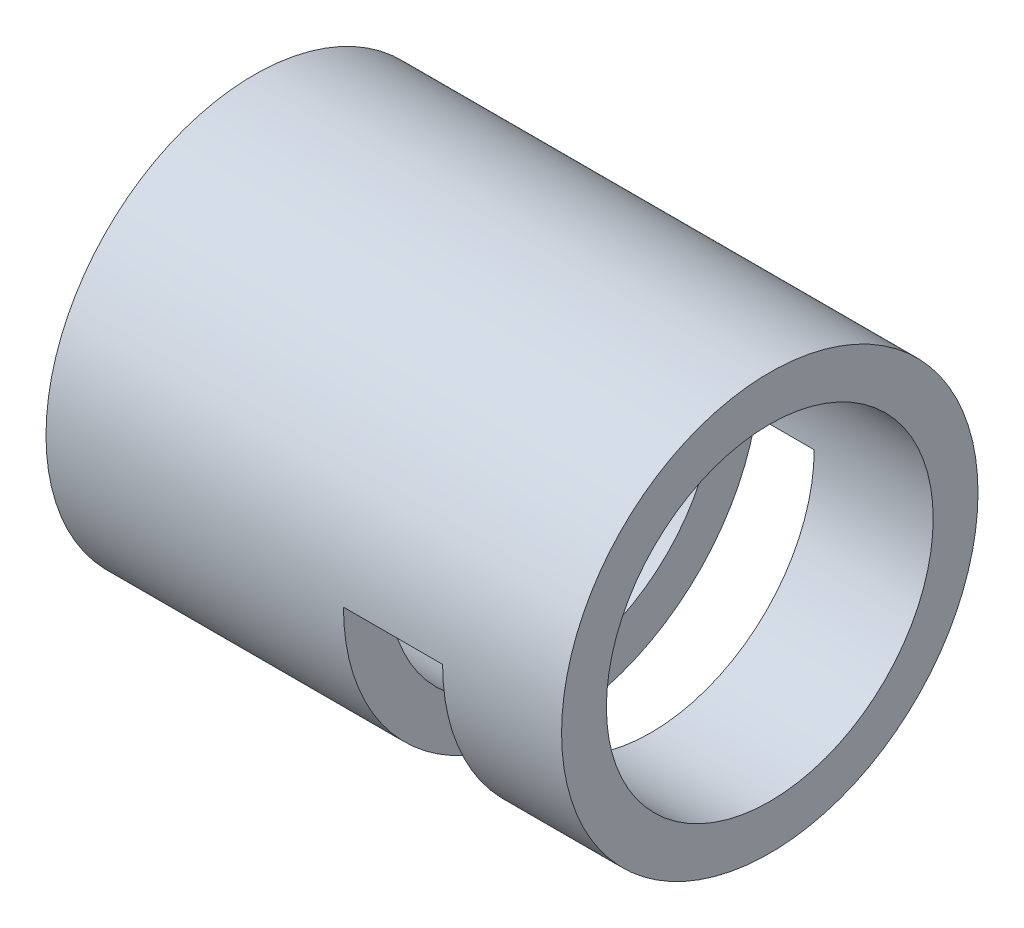
ISO-10303-21;
HEADER;
FILE_DESCRIPTION(('STEP AP214'),'2;1');
FILE_NAME('part.step','',(''),(''),'','','');
FILE_SCHEMA(('AUTOMOTIVE_DESIGN { 1 0 10303 214 1 1 1 1 }'));
ENDSEC;
DATA;
#1=APPLICATION_CONTEXT('core data for automotive mechanical design processes');
#2=APPLICATION_PROTOCOL_DEFINITION('international standard','automotive_design',2000,#1);
#3=PRODUCT_CONTEXT('',#1,'mechanical');
#4=PRODUCT('Part','Part','',(#3));
#5=PRODUCT_RELATED_PRODUCT_CATEGORY('part','',(#4));
#6=PRODUCT_DEFINITION_FORMATION('','',#4);
#7=PRODUCT_DEFINITION_CONTEXT('part definition',#1,'design');
#8=PRODUCT_DEFINITION('design','',#6,#7);
#9=PRODUCT_DEFINITION_SHAPE('','',#8);
#10=(LENGTH_UNIT() NAMED_UNIT(*) SI_UNIT(.MILLI.,.METRE.));
#11=(NAMED_UNIT(*) PLANE_ANGLE_UNIT() SI_UNIT($,.RADIAN.));
#12=(NAMED_UNIT(*) SI_UNIT($,.STERADIAN.) SOLID_ANGLE_UNIT());
#13=UNCERTAINTY_MEASURE_WITH_UNIT(LENGTH_MEASURE(1.E-05),#10,'distance_accuracy_value','');
#14=(GEOMETRIC_REPRESENTATION_CONTEXT(3) GLOBAL_UNCERTAINTY_ASSIGNED_CONTEXT((#13)) GLOBAL_UNIT_ASSIGNED_CONTEXT((#10,
#11,#12)) REPRESENTATION_CONTEXT('',''));
#15=CARTESIAN_POINT('',(0.,0.,0.));
#16=DIRECTION('',(0.,0.,1.));
#17=DIRECTION('',(1.,0.,0.));
#18=AXIS2_PLACEMENT_3D('',#15,#16,#17);
#19=CARTESIAN_POINT('',(33.02,0.,0.));
#20=DIRECTION('',(1.,0.,0.));
#21=DIRECTION('',(0.,0.,-1.));
#22=AXIS2_PLACEMENT_3D('',#19,#20,#21);
#23=PLANE('',#22);
#24=CARTESIAN_POINT('',(33.02,0.,0.));
#25=DIRECTION('',(1.,0.,0.));
#26=DIRECTION('',(0.,0.,-1.));
#27=AXIS2_PLACEMENT_3D('',#24,#25,#26);
#28=CIRCLE('',#27,13.335);
#29=CARTESIAN_POINT('',(33.02,0.,-13.335));
#30=VERTEX_POINT('',#29);
#31=EDGE_CURVE('E104',#30,#30,#28,.T.);
#32=ORIENTED_EDGE('',*,*,#31,.T.);
#33=EDGE_LOOP('',(#32));
#34=FACE_BOUND('',#33,.T.);
#35=CARTESIAN_POINT('',(33.02,0.,0.));
#36=DIRECTION('',(1.,0.,0.));
#37=DIRECTION('',(0.,0.,-1.));
#38=AXIS2_PLACEMENT_3D('',#35,#36,#37);
#39=CIRCLE('',#38,10.4648);
#40=CARTESIAN_POINT('',(33.02,0.,-10.4648));
#41=VERTEX_POINT('',#40);
#42=EDGE_CURVE('E98',#41,#41,#39,.T.);
#43=ORIENTED_EDGE('',*,*,#42,.F.);
#44=EDGE_LOOP('',(#43));
#45=FACE_BOUND('',#44,.T.);
#46=ADVANCED_FACE('F33',(#34,#45),#23,.T.);
#47=CARTESIAN_POINT('',(0.,0.,0.));
#48=DIRECTION('',(1.,0.,0.));
#49=DIRECTION('',(0.,0.,-1.));
#50=AXIS2_PLACEMENT_3D('',#47,#48,#49);
#51=PLANE('',#50);
#52=CARTESIAN_POINT('',(0.,0.,0.));
#53=DIRECTION('',(1.,0.,0.));
#54=DIRECTION('',(0.,0.,-1.));
#55=AXIS2_PLACEMENT_3D('',#52,#53,#54);
#56=CIRCLE('',#55,13.335);
#57=CARTESIAN_POINT('',(0.,0.,-13.335));
#58=VERTEX_POINT('',#57);
#59=EDGE_CURVE('E101',#58,#58,#56,.T.);
#60=ORIENTED_EDGE('',*,*,#59,.F.);
#61=EDGE_LOOP('',(#60));
#62=FACE_BOUND('',#61,.T.);
#63=CARTESIAN_POINT('',(0.,0.,0.));
#64=DIRECTION('',(1.,0.,0.));
#65=DIRECTION('',(0.,0.,-1.));
#66=AXIS2_PLACEMENT_3D('',#63,#64,#65);
#67=CIRCLE('',#66,10.4648);
#68=CARTESIAN_POINT('',(0.,0.,-10.4648));
#69=VERTEX_POINT('',#68);
#70=EDGE_CURVE('E80',#69,#69,#67,.T.);
#71=ORIENTED_EDGE('',*,*,#70,.T.);
#72=EDGE_LOOP('',(#71));
#73=FACE_BOUND('',#72,.T.);
#74=ADVANCED_FACE('F130',(#62,#73),#51,.F.);
#75=CARTESIAN_POINT('',(33.02,0.,0.));
#76=DIRECTION('',(-1.,0.,0.));
#77=DIRECTION('',(0.,0.,1.));
#78=AXIS2_PLACEMENT_3D('',#75,#76,#77);
#79=CYLINDRICAL_SURFACE('',#78,13.335);
#80=DIRECTION('',(-1.,0.,0.));
#81=VECTOR('',#80,1.);
#82=CARTESIAN_POINT('',(19.05,0.,-13.335));
#83=LINE('',#82,#81);
#84=CARTESIAN_POINT('',(25.4,0.,-13.335));
#85=VERTEX_POINT('',#84);
#86=CARTESIAN_POINT('',(19.05,0.,-13.335));
#87=VERTEX_POINT('',#86);
#88=EDGE_CURVE('E76',#85,#87,#83,.T.);
#89=ORIENTED_EDGE('',*,*,#88,.T.);
#90=CARTESIAN_POINT('',(19.05,0.,0.));
#91=DIRECTION('',(-1.,0.,0.));
#92=DIRECTION('',(0.,0.,1.));
#93=AXIS2_PLACEMENT_3D('',#90,#91,#92);
#94=CIRCLE('',#93,13.335);
#95=CARTESIAN_POINT('',(19.05,0.,13.335));
#96=VERTEX_POINT('',#95);
#97=EDGE_CURVE('E71',#87,#96,#94,.T.);
#98=ORIENTED_EDGE('',*,*,#97,.T.);
#99=DIRECTION('',(-1.,0.,0.));
#100=VECTOR('',#99,1.);
#101=CARTESIAN_POINT('',(19.05,0.,13.335));
#102=LINE('',#101,#100);
#103=CARTESIAN_POINT('',(25.4,0.,13.335));
#104=VERTEX_POINT('',#103);
#105=EDGE_CURVE('E74',#104,#96,#102,.T.);
#106=ORIENTED_EDGE('',*,*,#105,.F.);
#107=CARTESIAN_POINT('',(25.4,0.,0.));
#108=DIRECTION('',(1.,0.,0.));
#109=DIRECTION('',(0.,0.,-1.));
#110=AXIS2_PLACEMENT_3D('',#107,#108,#109);
#111=CIRCLE('',#110,13.335);
#112=EDGE_CURVE('E81',#104,#85,#111,.T.);
#113=ORIENTED_EDGE('',*,*,#112,.T.);
#114=EDGE_LOOP('',(#89,#98,#106,#113));
#115=FACE_BOUND('',#114,.T.);
#116=ORIENTED_EDGE('',*,*,#31,.F.);
#117=EDGE_LOOP('',(#116));
#118=FACE_BOUND('',#117,.T.);
#119=ORIENTED_EDGE('',*,*,#59,.T.);
#120=EDGE_LOOP('',(#119));
#121=FACE_BOUND('',#120,.T.);
#122=ADVANCED_FACE('F35',(#115,#118,#121),#79,.T.);
#123=CARTESIAN_POINT('',(33.02,0.,0.));
#124=DIRECTION('',(-1.,0.,0.));
#125=DIRECTION('',(0.,0.,1.));
#126=AXIS2_PLACEMENT_3D('',#123,#124,#125);
#127=CYLINDRICAL_SURFACE('',#126,10.4648);
#128=CARTESIAN_POINT('',(19.05,0.,0.));
#129=DIRECTION('',(-1.,0.,0.));
#130=DIRECTION('',(0.,0.,1.));
#131=AXIS2_PLACEMENT_3D('',#128,#129,#130);
#132=CIRCLE('',#131,10.4648);
#133=CARTESIAN_POINT('',(19.05,0.,-10.4648));
#134=VERTEX_POINT('',#133);
#135=CARTESIAN_POINT('',(19.05,0.,10.4648));
#136=VERTEX_POINT('',#135);
#137=EDGE_CURVE('E11',#134,#136,#132,.T.);
#138=ORIENTED_EDGE('',*,*,#137,.F.);
#139=DIRECTION('',(-1.,0.,0.));
#140=VECTOR('',#139,1.);
#141=CARTESIAN_POINT('',(33.02,0.,-10.4648));
#142=LINE('',#141,#140);
#143=CARTESIAN_POINT('',(25.4,0.,-10.4648));
#144=VERTEX_POINT('',#143);
#145=EDGE_CURVE('E41',#144,#134,#142,.T.);
#146=ORIENTED_EDGE('',*,*,#145,.F.);
#147=CARTESIAN_POINT('',(25.4,0.,0.));
#148=DIRECTION('',(1.,0.,0.));
#149=DIRECTION('',(0.,0.,-1.));
#150=AXIS2_PLACEMENT_3D('',#147,#148,#149);
#151=CIRCLE('',#150,10.4648);
#152=CARTESIAN_POINT('',(25.4,0.,10.4648));
#153=VERTEX_POINT('',#152);
#154=EDGE_CURVE('E107',#153,#144,#151,.T.);
#155=ORIENTED_EDGE('',*,*,#154,.F.);
#156=DIRECTION('',(-1.,0.,0.));
#157=VECTOR('',#156,1.);
#158=CARTESIAN_POINT('',(33.02,0.,10.4648));
#159=LINE('',#158,#157);
#160=EDGE_CURVE('E111',#136,#153,#159,.F.);
#161=ORIENTED_EDGE('',*,*,#160,.F.);
#162=EDGE_LOOP('',(#138,#146,#155,#161));
#163=FACE_BOUND('',#162,.T.);
#164=ORIENTED_EDGE('',*,*,#42,.T.);
#165=EDGE_LOOP('',(#164));
#166=FACE_BOUND('',#165,.T.);
#167=ORIENTED_EDGE('',*,*,#70,.F.);
#168=EDGE_LOOP('',(#167));
#169=FACE_BOUND('',#168,.T.);
#170=ADVANCED_FACE('F118',(#163,#166,#169),#127,.F.);
#171=CARTESIAN_POINT('',(19.05,-13.335,-13.335));
#172=DIRECTION('',(-1.,0.,0.));
#173=DIRECTION('',(0.,0.,1.));
#174=AXIS2_PLACEMENT_3D('',#171,#172,#173);
#175=PLANE('',#174);
#176=DIRECTION('',(0.,0.,1.));
#177=VECTOR('',#176,1.);
#178=CARTESIAN_POINT('',(19.05,0.,-13.335));
#179=LINE('',#178,#177);
#180=EDGE_CURVE('E88',#87,#134,#179,.T.);
#181=ORIENTED_EDGE('',*,*,#180,.T.);
#182=ORIENTED_EDGE('',*,*,#137,.T.);
#183=EDGE_CURVE('E84',#136,#96,#179,.T.);
#184=ORIENTED_EDGE('',*,*,#183,.T.);
#185=ORIENTED_EDGE('',*,*,#97,.F.);
#186=EDGE_LOOP('',(#181,#182,#184,#185));
#187=FACE_BOUND('',#186,.T.);
#188=ADVANCED_FACE('F85',(#187),#175,.F.);
#189=CARTESIAN_POINT('',(19.05,0.,-13.335));
#190=DIRECTION('',(0.,1.,0.));
#191=DIRECTION('',(0.,0.,1.));
#192=AXIS2_PLACEMENT_3D('',#189,#190,#191);
#193=PLANE('',#192);
#194=ORIENTED_EDGE('',*,*,#145,.T.);
#195=ORIENTED_EDGE('',*,*,#180,.F.);
#196=ORIENTED_EDGE('',*,*,#88,.F.);
#197=DIRECTION('',(0.,0.,1.));
#198=VECTOR('',#197,1.);
#199=CARTESIAN_POINT('',(25.4,0.,-13.335));
#200=LINE('',#199,#198);
#201=EDGE_CURVE('E89',#85,#144,#200,.T.);
#202=ORIENTED_EDGE('',*,*,#201,.T.);
#203=EDGE_LOOP('',(#194,#195,#196,#202));
#204=FACE_BOUND('',#203,.T.);
#205=ADVANCED_FACE('F114',(#204),#193,.F.);
#206=CARTESIAN_POINT('',(25.4,-13.335,-13.335));
#207=DIRECTION('',(1.,0.,0.));
#208=DIRECTION('',(0.,0.,-1.));
#209=AXIS2_PLACEMENT_3D('',#206,#207,#208);
#210=PLANE('',#209);
#211=EDGE_CURVE('E48',#153,#104,#200,.T.);
#212=ORIENTED_EDGE('',*,*,#211,.F.);
#213=ORIENTED_EDGE('',*,*,#154,.T.);
#214=ORIENTED_EDGE('',*,*,#201,.F.);
#215=ORIENTED_EDGE('',*,*,#112,.F.);
#216=EDGE_LOOP('',(#212,#213,#214,#215));
#217=FACE_BOUND('',#216,.T.);
#218=ADVANCED_FACE('F120',(#217),#210,.F.);
#219=ORIENTED_EDGE('',*,*,#160,.T.);
#220=ORIENTED_EDGE('',*,*,#211,.T.);
#221=ORIENTED_EDGE('',*,*,#105,.T.);
#222=ORIENTED_EDGE('',*,*,#183,.F.);
#223=EDGE_LOOP('',(#219,#220,#221,#222));
#224=FACE_BOUND('',#223,.T.);
#225=ADVANCED_FACE('F91',(#224),#193,.F.);
#226=CLOSED_SHELL('',(#46,#74,#122,#170,#188,#205,#218,#225));
#227=MANIFOLD_SOLID_BREP('B2',#226);
#228=ADVANCED_BREP_SHAPE_REPRESENTATION('',(#18,#227),#14);
#229=SHAPE_DEFINITION_REPRESENTATION(#9,#228);
ENDSEC;
END-ISO-10303-21;
